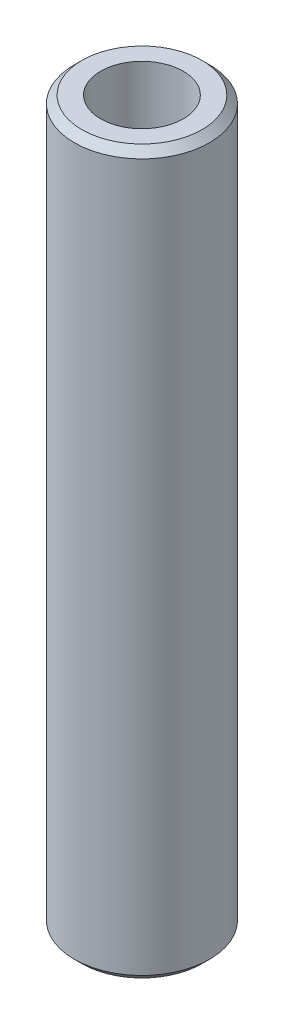
ISO-10303-21;
HEADER;
FILE_DESCRIPTION(('STEP AP214'),'2;1');
FILE_NAME('part.step','',(''),(''),'','','');
FILE_SCHEMA(('AUTOMOTIVE_DESIGN { 1 0 10303 214 1 1 1 1 }'));
ENDSEC;
DATA;
#1=APPLICATION_CONTEXT('core data for automotive mechanical design processes');
#2=APPLICATION_PROTOCOL_DEFINITION('international standard','automotive_design',2000,#1);
#3=PRODUCT_CONTEXT('',#1,'mechanical');
#4=PRODUCT('Part','Part','',(#3));
#5=PRODUCT_RELATED_PRODUCT_CATEGORY('part','',(#4));
#6=PRODUCT_DEFINITION_FORMATION('','',#4);
#7=PRODUCT_DEFINITION_CONTEXT('part definition',#1,'design');
#8=PRODUCT_DEFINITION('design','',#6,#7);
#9=PRODUCT_DEFINITION_SHAPE('','',#8);
#10=(LENGTH_UNIT() NAMED_UNIT(*) SI_UNIT(.MILLI.,.METRE.));
#11=(NAMED_UNIT(*) PLANE_ANGLE_UNIT() SI_UNIT($,.RADIAN.));
#12=(NAMED_UNIT(*) SI_UNIT($,.STERADIAN.) SOLID_ANGLE_UNIT());
#13=UNCERTAINTY_MEASURE_WITH_UNIT(LENGTH_MEASURE(1.E-05),#10,'distance_accuracy_value','');
#14=(GEOMETRIC_REPRESENTATION_CONTEXT(3) GLOBAL_UNCERTAINTY_ASSIGNED_CONTEXT((#13)) GLOBAL_UNIT_ASSIGNED_CONTEXT((#10,
#11,#12)) REPRESENTATION_CONTEXT('',''));
#15=CARTESIAN_POINT('',(0.,0.,0.));
#16=DIRECTION('',(0.,0.,1.));
#17=DIRECTION('',(1.,0.,0.));
#18=AXIS2_PLACEMENT_3D('',#15,#16,#17);
#19=CARTESIAN_POINT('',(0.,106.854336887553,0.));
#20=DIRECTION('',(0.,-1.,0.));
#21=DIRECTION('',(0.,0.,-1.));
#22=AXIS2_PLACEMENT_3D('',#19,#20,#21);
#23=CYLINDRICAL_SURFACE('',#22,10.);
#24=CARTESIAN_POINT('',(0.,105.737283774867,0.));
#25=DIRECTION('',(0.,1.,0.));
#26=DIRECTION('',(0.,0.,1.));
#27=AXIS2_PLACEMENT_3D('',#24,#25,#26);
#28=CIRCLE('',#27,10.);
#29=CARTESIAN_POINT('',(0.,105.737283774867,10.));
#30=VERTEX_POINT('',#29);
#31=EDGE_CURVE('E50',#30,#30,#28,.F.);
#32=ORIENTED_EDGE('',*,*,#31,.T.);
#33=EDGE_LOOP('',(#32));
#34=FACE_BOUND('',#33,.T.);
#35=CARTESIAN_POINT('',(0.,1.11705311268524,0.));
#36=DIRECTION('',(0.,1.,0.));
#37=DIRECTION('',(0.,0.,1.));
#38=AXIS2_PLACEMENT_3D('',#35,#36,#37);
#39=CIRCLE('',#38,10.);
#40=CARTESIAN_POINT('',(0.,1.11705311268524,10.));
#41=VERTEX_POINT('',#40);
#42=EDGE_CURVE('E51',#41,#41,#39,.T.);
#43=ORIENTED_EDGE('',*,*,#42,.T.);
#44=EDGE_LOOP('',(#43));
#45=FACE_BOUND('',#44,.T.);
#46=ADVANCED_FACE('F39',(#34,#45),#23,.T.);
#47=CARTESIAN_POINT('',(0.,106.854336887553,0.));
#48=DIRECTION('',(0.,1.,0.));
#49=DIRECTION('',(0.,0.,1.));
#50=AXIS2_PLACEMENT_3D('',#47,#48,#49);
#51=PLANE('',#50);
#52=CARTESIAN_POINT('',(0.,106.854336887553,0.));
#53=DIRECTION('',(0.,1.,0.));
#54=DIRECTION('',(0.,0.,1.));
#55=AXIS2_PLACEMENT_3D('',#52,#53,#54);
#56=CIRCLE('',#55,8.88294688731471);
#57=CARTESIAN_POINT('',(0.,106.854336887553,8.88294688731471));
#58=VERTEX_POINT('',#57);
#59=EDGE_CURVE('E54',#58,#58,#56,.T.);
#60=ORIENTED_EDGE('',*,*,#59,.T.);
#61=EDGE_LOOP('',(#60));
#62=FACE_BOUND('',#61,.T.);
#63=CARTESIAN_POINT('',(0.,106.854336887553,0.));
#64=DIRECTION('',(0.,1.,0.));
#65=DIRECTION('',(0.,0.,1.));
#66=AXIS2_PLACEMENT_3D('',#63,#64,#65);
#67=CIRCLE('',#66,6.11396944628894);
#68=CARTESIAN_POINT('',(0.,106.854336887553,6.11396944628894));
#69=VERTEX_POINT('',#68);
#70=EDGE_CURVE('E58',#69,#69,#67,.T.);
#71=ORIENTED_EDGE('',*,*,#70,.F.);
#72=EDGE_LOOP('',(#71));
#73=FACE_BOUND('',#72,.T.);
#74=ADVANCED_FACE('F69',(#62,#73),#51,.T.);
#75=CARTESIAN_POINT('',(0.,0.,0.));
#76=DIRECTION('',(0.,1.,0.));
#77=DIRECTION('',(0.,0.,1.));
#78=AXIS2_PLACEMENT_3D('',#75,#76,#77);
#79=PLANE('',#78);
#80=CARTESIAN_POINT('',(0.,0.,0.));
#81=DIRECTION('',(0.,1.,0.));
#82=DIRECTION('',(0.,0.,1.));
#83=AXIS2_PLACEMENT_3D('',#80,#81,#82);
#84=CIRCLE('',#83,8.88294688731475);
#85=CARTESIAN_POINT('',(0.,0.,8.88294688731475));
#86=VERTEX_POINT('',#85);
#87=EDGE_CURVE('E10',#86,#86,#84,.F.);
#88=ORIENTED_EDGE('',*,*,#87,.T.);
#89=EDGE_LOOP('',(#88));
#90=FACE_BOUND('',#89,.T.);
#91=CARTESIAN_POINT('',(0.,0.,0.));
#92=DIRECTION('',(0.,1.,0.));
#93=DIRECTION('',(0.,0.,1.));
#94=AXIS2_PLACEMENT_3D('',#91,#92,#93);
#95=CIRCLE('',#94,6.11396944628894);
#96=CARTESIAN_POINT('',(0.,0.,6.11396944628894));
#97=VERTEX_POINT('',#96);
#98=EDGE_CURVE('E63',#97,#97,#95,.T.);
#99=ORIENTED_EDGE('',*,*,#98,.T.);
#100=EDGE_LOOP('',(#99));
#101=FACE_BOUND('',#100,.T.);
#102=ADVANCED_FACE('F75',(#90,#101),#79,.F.);
#103=CARTESIAN_POINT('',(0.,106.854336887553,0.));
#104=DIRECTION('',(0.,-1.,0.));
#105=DIRECTION('',(0.,0.,-1.));
#106=AXIS2_PLACEMENT_3D('',#103,#104,#105);
#107=CYLINDRICAL_SURFACE('',#106,6.11396944628894);
#108=ORIENTED_EDGE('',*,*,#70,.T.);
#109=EDGE_LOOP('',(#108));
#110=FACE_BOUND('',#109,.T.);
#111=ORIENTED_EDGE('',*,*,#98,.F.);
#112=EDGE_LOOP('',(#111));
#113=FACE_BOUND('',#112,.T.);
#114=ADVANCED_FACE('F70',(#110,#113),#107,.F.);
#115=CARTESIAN_POINT('',(0.,106.854336887553,0.));
#116=DIRECTION('',(0.,-1.,0.));
#117=DIRECTION('',(0.,0.,-1.));
#118=AXIS2_PLACEMENT_3D('',#115,#116,#117);
#119=CONICAL_SURFACE('',#118,8.88294688731471,0.785398163397445);
#120=ORIENTED_EDGE('',*,*,#31,.F.);
#121=EDGE_LOOP('',(#120));
#122=FACE_BOUND('',#121,.T.);
#123=ORIENTED_EDGE('',*,*,#59,.F.);
#124=EDGE_LOOP('',(#123));
#125=FACE_BOUND('',#124,.T.);
#126=ADVANCED_FACE('F81',(#122,#125),#119,.T.);
#127=CARTESIAN_POINT('',(0.,1.11705311268524,0.));
#128=DIRECTION('',(0.,1.,0.));
#129=DIRECTION('',(0.,0.,1.));
#130=AXIS2_PLACEMENT_3D('',#127,#128,#129);
#131=CONICAL_SURFACE('',#130,10.,0.785398163397451);
#132=ORIENTED_EDGE('',*,*,#87,.F.);
#133=EDGE_LOOP('',(#132));
#134=FACE_BOUND('',#133,.T.);
#135=ORIENTED_EDGE('',*,*,#42,.F.);
#136=EDGE_LOOP('',(#135));
#137=FACE_BOUND('',#136,.T.);
#138=ADVANCED_FACE('F45',(#134,#137),#131,.T.);
#139=CLOSED_SHELL('',(#46,#74,#102,#114,#126,#138));
#140=MANIFOLD_SOLID_BREP('B2',#139);
#141=ADVANCED_BREP_SHAPE_REPRESENTATION('',(#18,#140),#14);
#142=SHAPE_DEFINITION_REPRESENTATION(#9,#141);
ENDSEC;
END-ISO-10303-21;
